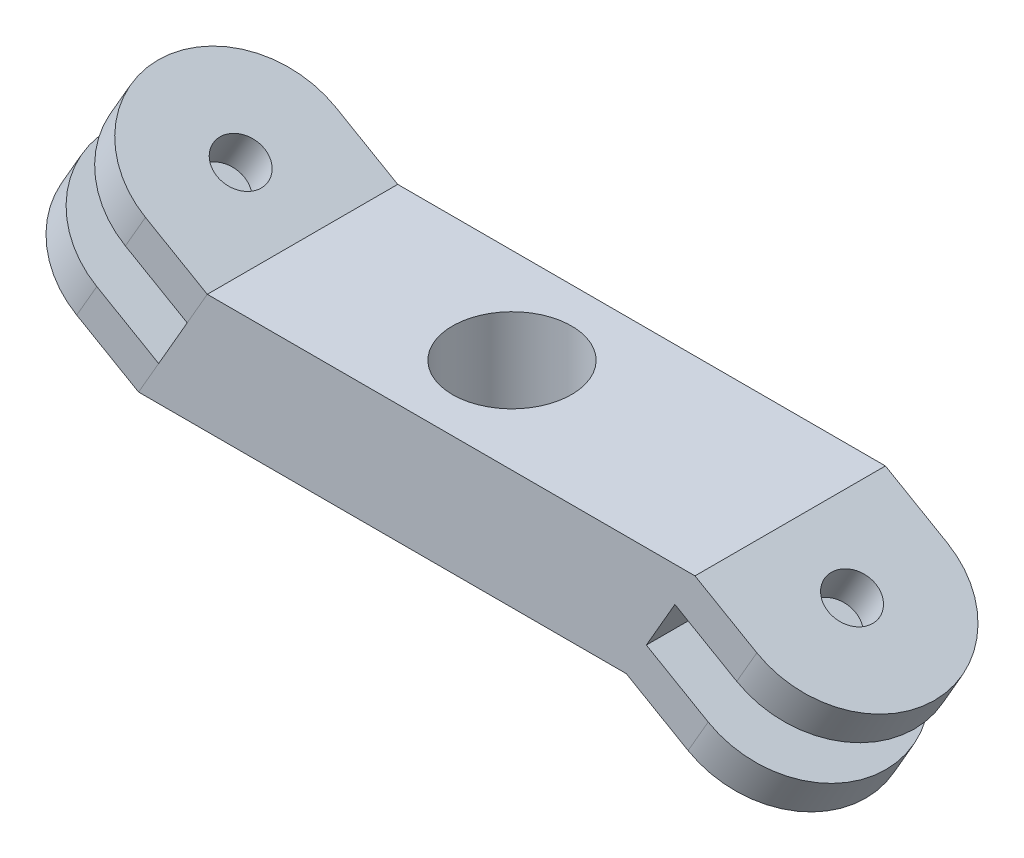
ISO-10303-21;
HEADER;
FILE_DESCRIPTION(('STEP AP214'),'2;1');
FILE_NAME('part.step','',(''),(''),'','','');
FILE_SCHEMA(('AUTOMOTIVE_DESIGN { 1 0 10303 214 1 1 1 1 }'));
ENDSEC;
DATA;
#1=APPLICATION_CONTEXT('core data for automotive mechanical design processes');
#2=APPLICATION_PROTOCOL_DEFINITION('international standard','automotive_design',2000,#1);
#3=PRODUCT_CONTEXT('',#1,'mechanical');
#4=PRODUCT('Part','Part','',(#3));
#5=PRODUCT_RELATED_PRODUCT_CATEGORY('part','',(#4));
#6=PRODUCT_DEFINITION_FORMATION('','',#4);
#7=PRODUCT_DEFINITION_CONTEXT('part definition',#1,'design');
#8=PRODUCT_DEFINITION('design','',#6,#7);
#9=PRODUCT_DEFINITION_SHAPE('','',#8);
#10=(LENGTH_UNIT() NAMED_UNIT(*) SI_UNIT(.MILLI.,.METRE.));
#11=(NAMED_UNIT(*) PLANE_ANGLE_UNIT() SI_UNIT($,.RADIAN.));
#12=(NAMED_UNIT(*) SI_UNIT($,.STERADIAN.) SOLID_ANGLE_UNIT());
#13=UNCERTAINTY_MEASURE_WITH_UNIT(LENGTH_MEASURE(1.E-05),#10,'distance_accuracy_value','');
#14=(GEOMETRIC_REPRESENTATION_CONTEXT(3) GLOBAL_UNCERTAINTY_ASSIGNED_CONTEXT((#13)) GLOBAL_UNIT_ASSIGNED_CONTEXT((#10,
#11,#12)) REPRESENTATION_CONTEXT('',''));
#15=CARTESIAN_POINT('',(0.,0.,0.));
#16=DIRECTION('',(0.,0.,1.));
#17=DIRECTION('',(1.,0.,0.));
#18=AXIS2_PLACEMENT_3D('',#15,#16,#17);
#19=CARTESIAN_POINT('',(-14.2853812281884,1.50000000000001,0.));
#20=DIRECTION('',(0.499999999999998,0.86602540378444,0.));
#21=DIRECTION('',(-0.86602540378444,0.499999999999998,0.));
#22=AXIS2_PLACEMENT_3D('',#19,#20,#21);
#23=CYLINDRICAL_SURFACE('',#22,4.);
#24=DIRECTION('',(0.499999999999998,0.86602540378444,0.));
#25=VECTOR('',#24,1.);
#26=CARTESIAN_POINT('',(-14.2853812281884,1.50000000000001,-4.));
#27=LINE('',#26,#25);
#28=CARTESIAN_POINT('',(-12.2420055552144,5.03923048454133,-4.));
#29=VERTEX_POINT('',#28);
#30=CARTESIAN_POINT('',(-11.3986298822403,6.5,-4.));
#31=VERTEX_POINT('',#30);
#32=EDGE_CURVE('E89',#29,#31,#27,.T.);
#33=ORIENTED_EDGE('',*,*,#32,.F.);
#34=CARTESIAN_POINT('',(-12.2420055552144,5.03923048454133,0.));
#35=DIRECTION('',(-0.499999999999998,-0.86602540378444,0.));
#36=DIRECTION('',(0.86602540378444,-0.499999999999998,0.));
#37=AXIS2_PLACEMENT_3D('',#34,#35,#36);
#38=CIRCLE('',#37,4.);
#39=CARTESIAN_POINT('',(-12.2420055552144,5.03923048454133,4.));
#40=VERTEX_POINT('',#39);
#41=EDGE_CURVE('E61',#29,#40,#38,.F.);
#42=ORIENTED_EDGE('',*,*,#41,.T.);
#43=DIRECTION('',(0.499999999999998,0.86602540378444,0.));
#44=VECTOR('',#43,1.);
#45=CARTESIAN_POINT('',(-14.2853812281884,1.50000000000001,4.));
#46=LINE('',#45,#44);
#47=CARTESIAN_POINT('',(-11.3986298822403,6.49999999999999,4.));
#48=VERTEX_POINT('',#47);
#49=EDGE_CURVE('E47',#40,#48,#46,.T.);
#50=ORIENTED_EDGE('',*,*,#49,.T.);
#51=CARTESIAN_POINT('',(-11.3986298822403,6.49999999999999,0.));
#52=DIRECTION('',(0.499999999999998,0.86602540378444,0.));
#53=DIRECTION('',(0.86602540378444,-0.499999999999998,0.));
#54=AXIS2_PLACEMENT_3D('',#51,#52,#53);
#55=CIRCLE('',#54,4.);
#56=EDGE_CURVE('E95',#31,#48,#55,.T.);
#57=ORIENTED_EDGE('',*,*,#56,.F.);
#58=EDGE_LOOP('',(#33,#42,#50,#57));
#59=FACE_BOUND('',#58,.T.);
#60=ADVANCED_FACE('F43',(#59),#23,.T.);
#61=CARTESIAN_POINT('',(-14.2853812281884,1.50000000000001,-4.));
#62=DIRECTION('',(0.,0.,-1.));
#63=DIRECTION('',(-1.,0.,0.));
#64=AXIS2_PLACEMENT_3D('',#61,#62,#63);
#65=PLANE('',#64);
#66=DIRECTION('',(0.499999999999998,0.86602540378444,0.));
#67=VECTOR('',#66,1.);
#68=CARTESIAN_POINT('',(-11.6873050168351,0.,-4.));
#69=LINE('',#68,#67);
#70=CARTESIAN_POINT('',(-9.64392934386108,3.53923048454133,-4.));
#71=VERTEX_POINT('',#70);
#72=CARTESIAN_POINT('',(-8.80055367088702,5.,-4.));
#73=VERTEX_POINT('',#72);
#74=EDGE_CURVE('E115',#71,#73,#69,.T.);
#75=ORIENTED_EDGE('',*,*,#74,.F.);
#76=DIRECTION('',(-0.86602540378444,0.499999999999998,0.));
#77=VECTOR('',#76,1.);
#78=CARTESIAN_POINT('',(-12.2420055552144,5.03923048454133,-4.));
#79=LINE('',#78,#77);
#80=EDGE_CURVE('E70',#71,#29,#79,.T.);
#81=ORIENTED_EDGE('',*,*,#80,.T.);
#82=ORIENTED_EDGE('',*,*,#32,.T.);
#83=DIRECTION('',(-0.86602540378444,0.499999999999998,0.));
#84=VECTOR('',#83,1.);
#85=CARTESIAN_POINT('',(-11.3986298822403,6.5,-4.));
#86=LINE('',#85,#84);
#87=EDGE_CURVE('E53',#73,#31,#86,.T.);
#88=ORIENTED_EDGE('',*,*,#87,.F.);
#89=EDGE_LOOP('',(#75,#81,#82,#88));
#90=FACE_BOUND('',#89,.T.);
#91=ADVANCED_FACE('F122',(#90),#65,.T.);
#92=CARTESIAN_POINT('',(-11.6873050168351,0.,4.));
#93=DIRECTION('',(0.86602540378444,-0.499999999999998,0.));
#94=DIRECTION('',(0.499999999999998,0.86602540378444,0.));
#95=AXIS2_PLACEMENT_3D('',#92,#93,#94);
#96=PLANE('',#95);
#97=DIRECTION('',(0.499999999999998,0.86602540378444,0.));
#98=VECTOR('',#97,1.);
#99=CARTESIAN_POINT('',(-11.6873050168351,0.,4.));
#100=LINE('',#99,#98);
#101=CARTESIAN_POINT('',(-9.64392934386108,3.53923048454133,4.));
#102=VERTEX_POINT('',#101);
#103=CARTESIAN_POINT('',(-8.80055367088702,5.,4.));
#104=VERTEX_POINT('',#103);
#105=EDGE_CURVE('E79',#102,#104,#100,.T.);
#106=ORIENTED_EDGE('',*,*,#105,.F.);
#107=DIRECTION('',(0.,0.,-1.));
#108=VECTOR('',#107,1.);
#109=CARTESIAN_POINT('',(-9.64392934386108,3.53923048454133,4.));
#110=LINE('',#109,#108);
#111=EDGE_CURVE('E113',#102,#71,#110,.T.);
#112=ORIENTED_EDGE('',*,*,#111,.T.);
#113=ORIENTED_EDGE('',*,*,#74,.T.);
#114=DIRECTION('',(0.,0.,-1.));
#115=VECTOR('',#114,1.);
#116=CARTESIAN_POINT('',(-8.80055367088702,5.,4.));
#117=LINE('',#116,#115);
#118=EDGE_CURVE('E102',#104,#73,#117,.T.);
#119=ORIENTED_EDGE('',*,*,#118,.F.);
#120=EDGE_LOOP('',(#106,#112,#113,#119));
#121=FACE_BOUND('',#120,.T.);
#122=ADVANCED_FACE('F121',(#121),#96,.T.);
#123=CARTESIAN_POINT('',(-14.2853812281884,1.50000000000001,4.));
#124=DIRECTION('',(0.,0.,1.));
#125=DIRECTION('',(1.,0.,0.));
#126=AXIS2_PLACEMENT_3D('',#123,#124,#125);
#127=PLANE('',#126);
#128=ORIENTED_EDGE('',*,*,#49,.F.);
#129=DIRECTION('',(0.86602540378444,-0.499999999999998,0.));
#130=VECTOR('',#129,1.);
#131=CARTESIAN_POINT('',(-12.2420055552144,5.03923048454133,4.));
#132=LINE('',#131,#130);
#133=EDGE_CURVE('E116',#40,#102,#132,.T.);
#134=ORIENTED_EDGE('',*,*,#133,.T.);
#135=ORIENTED_EDGE('',*,*,#105,.T.);
#136=DIRECTION('',(0.86602540378444,-0.499999999999998,0.));
#137=VECTOR('',#136,1.);
#138=CARTESIAN_POINT('',(-11.3986298822403,6.49999999999999,4.));
#139=LINE('',#138,#137);
#140=EDGE_CURVE('E98',#48,#104,#139,.T.);
#141=ORIENTED_EDGE('',*,*,#140,.F.);
#142=EDGE_LOOP('',(#128,#134,#135,#141));
#143=FACE_BOUND('',#142,.T.);
#144=ADVANCED_FACE('F99',(#143),#127,.T.);
#145=CARTESIAN_POINT('',(-15.6995947905615,-0.94948974278318,0.));
#146=DIRECTION('',(0.499999999999998,0.86602540378444,0.));
#147=DIRECTION('',(-0.86602540378444,0.499999999999998,0.));
#148=AXIS2_PLACEMENT_3D('',#145,#146,#147);
#149=CYLINDRICAL_SURFACE('',#148,1.);
#150=CARTESIAN_POINT('',(-11.3986298822403,6.49999999999999,0.));
#151=DIRECTION('',(0.499999999999998,0.86602540378444,0.));
#152=DIRECTION('',(-0.86602540378444,0.499999999999998,0.));
#153=AXIS2_PLACEMENT_3D('',#150,#151,#152);
#154=CIRCLE('',#153,1.);
#155=CARTESIAN_POINT('',(-12.2646552860248,6.99999999999999,0.));
#156=VERTEX_POINT('',#155);
#157=EDGE_CURVE('E105',#156,#156,#154,.T.);
#158=ORIENTED_EDGE('',*,*,#157,.T.);
#159=EDGE_LOOP('',(#158));
#160=FACE_BOUND('',#159,.T.);
#161=CARTESIAN_POINT('',(-12.2420055552144,5.03923048454133,0.));
#162=DIRECTION('',(-0.499999999999998,-0.86602540378444,0.));
#163=DIRECTION('',(0.86602540378444,-0.499999999999998,0.));
#164=AXIS2_PLACEMENT_3D('',#161,#162,#163);
#165=CIRCLE('',#164,1.);
#166=CARTESIAN_POINT('',(-11.37598015143,4.53923048454133,0.));
#167=VERTEX_POINT('',#166);
#168=EDGE_CURVE('E12',#167,#167,#165,.F.);
#169=ORIENTED_EDGE('',*,*,#168,.F.);
#170=EDGE_LOOP('',(#169));
#171=FACE_BOUND('',#170,.T.);
#172=ADVANCED_FACE('F45',(#160,#171),#149,.F.);
#173=CARTESIAN_POINT('',(-11.3986298822403,6.49999999999999,0.));
#174=DIRECTION('',(-0.499999999999998,-0.86602540378444,0.));
#175=DIRECTION('',(0.86602540378444,-0.499999999999998,0.));
#176=AXIS2_PLACEMENT_3D('',#173,#174,#175);
#177=PLANE('',#176);
#178=ORIENTED_EDGE('',*,*,#157,.F.);
#179=EDGE_LOOP('',(#178));
#180=FACE_BOUND('',#179,.T.);
#181=ORIENTED_EDGE('',*,*,#56,.T.);
#182=ORIENTED_EDGE('',*,*,#140,.T.);
#183=ORIENTED_EDGE('',*,*,#118,.T.);
#184=ORIENTED_EDGE('',*,*,#87,.T.);
#185=EDGE_LOOP('',(#181,#182,#183,#184));
#186=FACE_BOUND('',#185,.T.);
#187=ADVANCED_FACE('F104',(#180,#186),#177,.F.);
#188=CARTESIAN_POINT('',(-0.878450581234703,-1.52152103863692,0.));
#189=DIRECTION('',(-0.499999999999998,-0.86602540378444,0.));
#190=DIRECTION('',(0.86602540378444,-0.499999999999998,0.));
#191=AXIS2_PLACEMENT_3D('',#188,#189,#190);
#192=PLANE('',#191);
#193=ORIENTED_EDGE('',*,*,#80,.F.);
#194=ORIENTED_EDGE('',*,*,#111,.F.);
#195=ORIENTED_EDGE('',*,*,#133,.F.);
#196=ORIENTED_EDGE('',*,*,#41,.F.);
#197=EDGE_LOOP('',(#193,#194,#195,#196));
#198=FACE_BOUND('',#197,.T.);
#199=ORIENTED_EDGE('',*,*,#168,.T.);
#200=EDGE_LOOP('',(#199));
#201=FACE_BOUND('',#200,.T.);
#202=ADVANCED_FACE('F134',(#198,#201),#192,.T.);
#203=CLOSED_SHELL('',(#60,#91,#122,#144,#172,#187,#202));
#204=MANIFOLD_SOLID_BREP('B2',#203);
#205=CARTESIAN_POINT('',(-14.2853812281884,1.50000000000001,4.));
#206=DIRECTION('',(0.,0.,1.));
#207=DIRECTION('',(1.,0.,0.));
#208=AXIS2_PLACEMENT_3D('',#205,#206,#207);
#209=PLANE('',#208);
#210=DIRECTION('',(0.86602540378444,-0.499999999999998,0.));
#211=VECTOR('',#210,1.);
#212=CARTESIAN_POINT('',(-13.4420055552144,2.96076951545867,4.));
#213=LINE('',#212,#211);
#214=CARTESIAN_POINT('',(-13.4420055552144,2.96076951545867,4.));
#215=VERTEX_POINT('',#214);
#216=CARTESIAN_POINT('',(-10.8439293438611,1.46076951545868,4.));
#217=VERTEX_POINT('',#216);
#218=EDGE_CURVE('E235',#215,#217,#213,.T.);
#219=ORIENTED_EDGE('',*,*,#218,.F.);
#220=DIRECTION('',(0.499999999999998,0.86602540378444,0.));
#221=VECTOR('',#220,1.);
#222=CARTESIAN_POINT('',(-14.2853812281884,1.50000000000001,4.));
#223=LINE('',#222,#221);
#224=CARTESIAN_POINT('',(-14.2853812281884,1.50000000000001,4.));
#225=VERTEX_POINT('',#224);
#226=EDGE_CURVE('E256',#225,#215,#223,.T.);
#227=ORIENTED_EDGE('',*,*,#226,.F.);
#228=DIRECTION('',(0.86602540378444,-0.499999999999998,0.));
#229=VECTOR('',#228,1.);
#230=CARTESIAN_POINT('',(-14.2853812281884,1.50000000000001,4.));
#231=LINE('',#230,#229);
#232=CARTESIAN_POINT('',(-11.6873050168351,0.,4.));
#233=VERTEX_POINT('',#232);
#234=EDGE_CURVE('E255',#225,#233,#231,.T.);
#235=ORIENTED_EDGE('',*,*,#234,.T.);
#236=DIRECTION('',(0.499999999999998,0.86602540378444,0.));
#237=VECTOR('',#236,1.);
#238=CARTESIAN_POINT('',(-11.6873050168351,0.,4.));
#239=LINE('',#238,#237);
#240=EDGE_CURVE('E249',#233,#217,#239,.T.);
#241=ORIENTED_EDGE('',*,*,#240,.T.);
#242=EDGE_LOOP('',(#219,#227,#235,#241));
#243=FACE_BOUND('',#242,.T.);
#244=ADVANCED_FACE('F196',(#243),#209,.T.);
#245=CARTESIAN_POINT('',(-11.6873050168351,0.,4.));
#246=DIRECTION('',(0.86602540378444,-0.499999999999998,0.));
#247=DIRECTION('',(0.499999999999998,0.86602540378444,0.));
#248=AXIS2_PLACEMENT_3D('',#245,#246,#247);
#249=PLANE('',#248);
#250=DIRECTION('',(0.,0.,-1.));
#251=VECTOR('',#250,1.);
#252=CARTESIAN_POINT('',(-10.8439293438611,1.46076951545868,4.));
#253=LINE('',#252,#251);
#254=CARTESIAN_POINT('',(-10.8439293438611,1.46076951545868,-4.));
#255=VERTEX_POINT('',#254);
#256=EDGE_CURVE('E239',#217,#255,#253,.T.);
#257=ORIENTED_EDGE('',*,*,#256,.F.);
#258=ORIENTED_EDGE('',*,*,#240,.F.);
#259=DIRECTION('',(0.,0.,-1.));
#260=VECTOR('',#259,1.);
#261=CARTESIAN_POINT('',(-11.6873050168351,0.,4.));
#262=LINE('',#261,#260);
#263=CARTESIAN_POINT('',(-11.6873050168351,0.,-4.));
#264=VERTEX_POINT('',#263);
#265=EDGE_CURVE('E263',#233,#264,#262,.T.);
#266=ORIENTED_EDGE('',*,*,#265,.T.);
#267=DIRECTION('',(0.499999999999998,0.86602540378444,0.));
#268=VECTOR('',#267,1.);
#269=CARTESIAN_POINT('',(-11.6873050168351,0.,-4.));
#270=LINE('',#269,#268);
#271=EDGE_CURVE('E205',#264,#255,#270,.T.);
#272=ORIENTED_EDGE('',*,*,#271,.T.);
#273=EDGE_LOOP('',(#257,#258,#266,#272));
#274=FACE_BOUND('',#273,.T.);
#275=ADVANCED_FACE('F247',(#274),#249,.T.);
#276=CARTESIAN_POINT('',(-14.2853812281884,1.50000000000001,-4.));
#277=DIRECTION('',(0.,0.,-1.));
#278=DIRECTION('',(-1.,0.,0.));
#279=AXIS2_PLACEMENT_3D('',#276,#277,#278);
#280=PLANE('',#279);
#281=DIRECTION('',(-0.86602540378444,0.499999999999998,0.));
#282=VECTOR('',#281,1.);
#283=CARTESIAN_POINT('',(-13.4420055552144,2.96076951545867,-4.));
#284=LINE('',#283,#282);
#285=CARTESIAN_POINT('',(-13.4420055552144,2.96076951545867,-4.));
#286=VERTEX_POINT('',#285);
#287=EDGE_CURVE('E251',#255,#286,#284,.T.);
#288=ORIENTED_EDGE('',*,*,#287,.F.);
#289=ORIENTED_EDGE('',*,*,#271,.F.);
#290=DIRECTION('',(-0.86602540378444,0.499999999999998,0.));
#291=VECTOR('',#290,1.);
#292=CARTESIAN_POINT('',(-14.2853812281884,1.50000000000001,-4.));
#293=LINE('',#292,#291);
#294=CARTESIAN_POINT('',(-14.2853812281884,1.50000000000001,-4.));
#295=VERTEX_POINT('',#294);
#296=EDGE_CURVE('E259',#264,#295,#293,.T.);
#297=ORIENTED_EDGE('',*,*,#296,.T.);
#298=DIRECTION('',(0.499999999999998,0.86602540378444,0.));
#299=VECTOR('',#298,1.);
#300=CARTESIAN_POINT('',(-14.2853812281884,1.50000000000001,-4.));
#301=LINE('',#300,#299);
#302=EDGE_CURVE('E41',#295,#286,#301,.T.);
#303=ORIENTED_EDGE('',*,*,#302,.T.);
#304=EDGE_LOOP('',(#288,#289,#297,#303));
#305=FACE_BOUND('',#304,.T.);
#306=ADVANCED_FACE('F273',(#305),#280,.T.);
#307=CARTESIAN_POINT('',(-14.2853812281884,1.50000000000001,0.));
#308=DIRECTION('',(0.499999999999998,0.86602540378444,0.));
#309=DIRECTION('',(-0.86602540378444,0.499999999999998,0.));
#310=AXIS2_PLACEMENT_3D('',#307,#308,#309);
#311=CYLINDRICAL_SURFACE('',#310,4.);
#312=CARTESIAN_POINT('',(-13.4420055552144,2.96076951545867,0.));
#313=DIRECTION('',(-0.499999999999998,-0.86602540378444,0.));
#314=DIRECTION('',(0.86602540378444,-0.499999999999998,0.));
#315=AXIS2_PLACEMENT_3D('',#312,#313,#314);
#316=CIRCLE('',#315,4.);
#317=EDGE_CURVE('E213',#286,#215,#316,.F.);
#318=ORIENTED_EDGE('',*,*,#317,.F.);
#319=ORIENTED_EDGE('',*,*,#302,.F.);
#320=CARTESIAN_POINT('',(-14.2853812281884,1.50000000000001,0.));
#321=DIRECTION('',(0.499999999999998,0.86602540378444,0.));
#322=DIRECTION('',(0.86602540378444,-0.499999999999998,0.));
#323=AXIS2_PLACEMENT_3D('',#320,#321,#322);
#324=CIRCLE('',#323,4.);
#325=EDGE_CURVE('E266',#295,#225,#324,.T.);
#326=ORIENTED_EDGE('',*,*,#325,.T.);
#327=ORIENTED_EDGE('',*,*,#226,.T.);
#328=EDGE_LOOP('',(#318,#319,#326,#327));
#329=FACE_BOUND('',#328,.T.);
#330=ADVANCED_FACE('F198',(#329),#311,.T.);
#331=CARTESIAN_POINT('',(-14.2853812281884,1.50000000000001,0.));
#332=DIRECTION('',(-0.499999999999998,-0.86602540378444,0.));
#333=DIRECTION('',(0.86602540378444,-0.499999999999998,0.));
#334=AXIS2_PLACEMENT_3D('',#331,#332,#333);
#335=PLANE('',#334);
#336=CARTESIAN_POINT('',(-14.2853812281884,1.50000000000001,0.));
#337=DIRECTION('',(-0.499999999999998,-0.86602540378444,0.));
#338=DIRECTION('',(0.86602540378444,-0.499999999999998,0.));
#339=AXIS2_PLACEMENT_3D('',#336,#337,#338);
#340=CIRCLE('',#339,1.);
#341=CARTESIAN_POINT('',(-13.419355824404,1.00000000000001,0.));
#342=VERTEX_POINT('',#341);
#343=EDGE_CURVE('E268',#342,#342,#340,.F.);
#344=ORIENTED_EDGE('',*,*,#343,.T.);
#345=EDGE_LOOP('',(#344));
#346=FACE_BOUND('',#345,.T.);
#347=ORIENTED_EDGE('',*,*,#325,.F.);
#348=ORIENTED_EDGE('',*,*,#296,.F.);
#349=ORIENTED_EDGE('',*,*,#265,.F.);
#350=ORIENTED_EDGE('',*,*,#234,.F.);
#351=EDGE_LOOP('',(#347,#348,#349,#350));
#352=FACE_BOUND('',#351,.T.);
#353=ADVANCED_FACE('F276',(#346,#352),#335,.T.);
#354=CARTESIAN_POINT('',(-15.6995947905615,-0.94948974278318,0.));
#355=DIRECTION('',(0.499999999999998,0.86602540378444,0.));
#356=DIRECTION('',(-0.86602540378444,0.499999999999998,0.));
#357=AXIS2_PLACEMENT_3D('',#354,#355,#356);
#358=CYLINDRICAL_SURFACE('',#357,1.);
#359=CARTESIAN_POINT('',(-13.4420055552144,2.96076951545867,0.));
#360=DIRECTION('',(-0.499999999999998,-0.86602540378444,0.));
#361=DIRECTION('',(0.86602540378444,-0.499999999999998,0.));
#362=AXIS2_PLACEMENT_3D('',#359,#360,#361);
#363=CIRCLE('',#362,1.);
#364=CARTESIAN_POINT('',(-12.5759801514299,2.46076951545867,0.));
#365=VERTEX_POINT('',#364);
#366=EDGE_CURVE('E200',#365,#365,#363,.F.);
#367=ORIENTED_EDGE('',*,*,#366,.T.);
#368=EDGE_LOOP('',(#367));
#369=FACE_BOUND('',#368,.T.);
#370=ORIENTED_EDGE('',*,*,#343,.F.);
#371=EDGE_LOOP('',(#370));
#372=FACE_BOUND('',#371,.T.);
#373=ADVANCED_FACE('F278',(#369,#372),#358,.F.);
#374=CARTESIAN_POINT('',(-2.0784505812347,-3.59998200771958,0.));
#375=DIRECTION('',(-0.499999999999998,-0.86602540378444,0.));
#376=DIRECTION('',(0.86602540378444,-0.499999999999998,0.));
#377=AXIS2_PLACEMENT_3D('',#374,#375,#376);
#378=PLANE('',#377);
#379=ORIENTED_EDGE('',*,*,#317,.T.);
#380=ORIENTED_EDGE('',*,*,#218,.T.);
#381=ORIENTED_EDGE('',*,*,#256,.T.);
#382=ORIENTED_EDGE('',*,*,#287,.T.);
#383=EDGE_LOOP('',(#379,#380,#381,#382));
#384=FACE_BOUND('',#383,.T.);
#385=ORIENTED_EDGE('',*,*,#366,.F.);
#386=EDGE_LOOP('',(#385));
#387=FACE_BOUND('',#386,.T.);
#388=ADVANCED_FACE('F237',(#384,#387),#378,.F.);
#389=CLOSED_SHELL('',(#244,#275,#306,#330,#353,#373,#388));
#390=MANIFOLD_SOLID_BREP('B6',#389);
#391=CARTESIAN_POINT('',(0.,0.,0.));
#392=DIRECTION('',(0.,1.,0.));
#393=DIRECTION('',(0.,0.,1.));
#394=AXIS2_PLACEMENT_3D('',#391,#392,#393);
#395=PLANE('',#394);
#396=CARTESIAN_POINT('',(0.,0.,0.));
#397=DIRECTION('',(0.,1.,0.));
#398=DIRECTION('',(0.,0.,1.));
#399=AXIS2_PLACEMENT_3D('',#396,#397,#398);
#400=CIRCLE('',#399,2.5);
#401=CARTESIAN_POINT('',(0.,0.,2.5));
#402=VERTEX_POINT('',#401);
#403=EDGE_CURVE('E194',#402,#402,#400,.F.);
#404=ORIENTED_EDGE('',*,*,#403,.F.);
#405=EDGE_LOOP('',(#404));
#406=FACE_BOUND('',#405,.T.);
#407=DIRECTION('',(0.,0.,-1.));
#408=VECTOR('',#407,1.);
#409=CARTESIAN_POINT('',(8.80055367088702,0.,0.));
#410=LINE('',#409,#408);
#411=CARTESIAN_POINT('',(8.80055367088702,0.,4.));
#412=VERTEX_POINT('',#411);
#413=CARTESIAN_POINT('',(8.80055367088702,0.,-4.));
#414=VERTEX_POINT('',#413);
#415=EDGE_CURVE('E490',#412,#414,#410,.T.);
#416=ORIENTED_EDGE('',*,*,#415,.F.);
#417=DIRECTION('',(1.,0.,0.));
#418=VECTOR('',#417,1.);
#419=CARTESIAN_POINT('',(-3.07009589621998,0.,4.));
#420=LINE('',#419,#418);
#421=CARTESIAN_POINT('',(-11.6873050168351,0.,4.));
#422=VERTEX_POINT('',#421);
#423=EDGE_CURVE('E506',#422,#412,#420,.T.);
#424=ORIENTED_EDGE('',*,*,#423,.F.);
#425=DIRECTION('',(0.,0.,1.));
#426=VECTOR('',#425,1.);
#427=CARTESIAN_POINT('',(-11.6873050168351,0.,-4.));
#428=LINE('',#427,#426);
#429=CARTESIAN_POINT('',(-11.6873050168351,0.,-4.));
#430=VERTEX_POINT('',#429);
#431=EDGE_CURVE('E513',#430,#422,#428,.T.);
#432=ORIENTED_EDGE('',*,*,#431,.F.);
#433=DIRECTION('',(1.,0.,0.));
#434=VECTOR('',#433,1.);
#435=CARTESIAN_POINT('',(-3.07009589621998,0.,-4.));
#436=LINE('',#435,#434);
#437=EDGE_CURVE('E511',#430,#414,#436,.T.);
#438=ORIENTED_EDGE('',*,*,#437,.T.);
#439=EDGE_LOOP('',(#416,#424,#432,#438));
#440=FACE_BOUND('',#439,.T.);
#441=ADVANCED_FACE('F340',(#406,#440),#395,.F.);
#442=CARTESIAN_POINT('',(0.,5.,0.));
#443=DIRECTION('',(0.,1.,0.));
#444=DIRECTION('',(0.,0.,1.));
#445=AXIS2_PLACEMENT_3D('',#442,#443,#444);
#446=PLANE('',#445);
#447=DIRECTION('',(-1.,0.,0.));
#448=VECTOR('',#447,1.);
#449=CARTESIAN_POINT('',(-3.07009589621998,5.,4.));
#450=LINE('',#449,#448);
#451=CARTESIAN_POINT('',(11.6873050168351,4.99999999999999,4.));
#452=VERTEX_POINT('',#451);
#453=CARTESIAN_POINT('',(-8.80055367088702,5.,4.));
#454=VERTEX_POINT('',#453);
#455=EDGE_CURVE('E504',#452,#454,#450,.T.);
#456=ORIENTED_EDGE('',*,*,#455,.F.);
#457=DIRECTION('',(0.,0.,1.));
#458=VECTOR('',#457,1.);
#459=CARTESIAN_POINT('',(11.6873050168351,5.,-4.));
#460=LINE('',#459,#458);
#461=CARTESIAN_POINT('',(11.6873050168351,5.,-4.));
#462=VERTEX_POINT('',#461);
#463=EDGE_CURVE('E493',#462,#452,#460,.T.);
#464=ORIENTED_EDGE('',*,*,#463,.F.);
#465=DIRECTION('',(-1.,0.,0.));
#466=VECTOR('',#465,1.);
#467=CARTESIAN_POINT('',(-3.07009589621998,5.,-4.));
#468=LINE('',#467,#466);
#469=CARTESIAN_POINT('',(-8.80055367088702,5.,-4.));
#470=VERTEX_POINT('',#469);
#471=EDGE_CURVE('E508',#462,#470,#468,.T.);
#472=ORIENTED_EDGE('',*,*,#471,.T.);
#473=DIRECTION('',(0.,0.,1.));
#474=VECTOR('',#473,1.);
#475=CARTESIAN_POINT('',(-8.80055367088702,5.,0.));
#476=LINE('',#475,#474);
#477=EDGE_CURVE('E501',#470,#454,#476,.T.);
#478=ORIENTED_EDGE('',*,*,#477,.T.);
#479=EDGE_LOOP('',(#456,#464,#472,#478));
#480=FACE_BOUND('',#479,.T.);
#481=CARTESIAN_POINT('',(0.,5.,0.));
#482=DIRECTION('',(0.,1.,0.));
#483=DIRECTION('',(0.,0.,1.));
#484=AXIS2_PLACEMENT_3D('',#481,#482,#483);
#485=CIRCLE('',#484,2.5);
#486=CARTESIAN_POINT('',(0.,5.,2.5));
#487=VERTEX_POINT('',#486);
#488=EDGE_CURVE('E347',#487,#487,#485,.T.);
#489=ORIENTED_EDGE('',*,*,#488,.F.);
#490=EDGE_LOOP('',(#489));
#491=FACE_BOUND('',#490,.T.);
#492=ADVANCED_FACE('F519',(#480,#491),#446,.T.);
#493=CARTESIAN_POINT('',(0.,0.,-4.));
#494=DIRECTION('',(0.,0.,1.));
#495=DIRECTION('',(1.,0.,0.));
#496=AXIS2_PLACEMENT_3D('',#493,#494,#495);
#497=PLANE('',#496);
#498=DIRECTION('',(-0.499999999999998,-0.86602540378444,0.));
#499=VECTOR('',#498,1.);
#500=CARTESIAN_POINT('',(-8.76547876262637,5.06075152317826,-4.));
#501=LINE('',#500,#499);
#502=EDGE_CURVE('E499',#470,#430,#501,.T.);
#503=ORIENTED_EDGE('',*,*,#502,.F.);
#504=ORIENTED_EDGE('',*,*,#471,.F.);
#505=DIRECTION('',(0.86602540378444,-0.499999999999998,0.));
#506=VECTOR('',#505,1.);
#507=CARTESIAN_POINT('',(14.2853812281884,3.49999999999999,-4.));
#508=LINE('',#507,#506);
#509=CARTESIAN_POINT('',(14.2853812281884,3.49999999999999,-4.));
#510=VERTEX_POINT('',#509);
#511=EDGE_CURVE('E471',#462,#510,#508,.T.);
#512=ORIENTED_EDGE('',*,*,#511,.T.);
#513=DIRECTION('',(-0.499999999999998,-0.86602540378444,0.));
#514=VECTOR('',#513,1.);
#515=CARTESIAN_POINT('',(14.2853812281884,3.49999999999999,-4.));
#516=LINE('',#515,#514);
#517=CARTESIAN_POINT('',(13.4420055552144,2.03923048454133,-4.));
#518=VERTEX_POINT('',#517);
#519=EDGE_CURVE('E473',#510,#518,#516,.T.);
#520=ORIENTED_EDGE('',*,*,#519,.T.);
#521=DIRECTION('',(0.86602540378444,-0.499999999999998,0.));
#522=VECTOR('',#521,1.);
#523=CARTESIAN_POINT('',(13.4420055552144,2.03923048454133,-4.));
#524=LINE('',#523,#522);
#525=CARTESIAN_POINT('',(10.8439293438611,3.53923048454132,-4.));
#526=VERTEX_POINT('',#525);
#527=EDGE_CURVE('E469',#526,#518,#524,.T.);
#528=ORIENTED_EDGE('',*,*,#527,.F.);
#529=DIRECTION('',(0.499999999999998,0.86602540378444,0.));
#530=VECTOR('',#529,1.);
#531=CARTESIAN_POINT('',(6.60041525316528,-3.81075152317827,-4.));
#532=LINE('',#531,#530);
#533=CARTESIAN_POINT('',(9.64392934386107,1.46076951545867,-4.));
#534=VERTEX_POINT('',#533);
#535=EDGE_CURVE('E439',#534,#526,#532,.T.);
#536=ORIENTED_EDGE('',*,*,#535,.F.);
#537=DIRECTION('',(0.86602540378444,-0.499999999999998,0.));
#538=VECTOR('',#537,1.);
#539=CARTESIAN_POINT('',(12.2420055552144,-0.0392304845413284,-4.));
#540=LINE('',#539,#538);
#541=CARTESIAN_POINT('',(12.2420055552144,-0.0392304845413293,-4.));
#542=VERTEX_POINT('',#541);
#543=EDGE_CURVE('E432',#534,#542,#540,.T.);
#544=ORIENTED_EDGE('',*,*,#543,.T.);
#545=DIRECTION('',(-0.499999999999998,-0.86602540378444,0.));
#546=VECTOR('',#545,1.);
#547=CARTESIAN_POINT('',(14.2853812281884,3.49999999999999,-4.));
#548=LINE('',#547,#546);
#549=CARTESIAN_POINT('',(11.3986298822403,-1.5,-4.));
#550=VERTEX_POINT('',#549);
#551=EDGE_CURVE('E415',#542,#550,#548,.T.);
#552=ORIENTED_EDGE('',*,*,#551,.T.);
#553=DIRECTION('',(0.86602540378444,-0.499999999999998,0.));
#554=VECTOR('',#553,1.);
#555=CARTESIAN_POINT('',(11.3986298822403,-1.5,-4.));
#556=LINE('',#555,#554);
#557=EDGE_CURVE('E440',#414,#550,#556,.T.);
#558=ORIENTED_EDGE('',*,*,#557,.F.);
#559=ORIENTED_EDGE('',*,*,#437,.F.);
#560=EDGE_LOOP('',(#503,#504,#512,#520,#528,#536,#544,#552,#558,#559));
#561=FACE_BOUND('',#560,.T.);
#562=ADVANCED_FACE('F437',(#561),#497,.F.);
#563=CARTESIAN_POINT('',(0.,0.,4.));
#564=DIRECTION('',(0.,0.,1.));
#565=DIRECTION('',(1.,0.,0.));
#566=AXIS2_PLACEMENT_3D('',#563,#564,#565);
#567=PLANE('',#566);
#568=ORIENTED_EDGE('',*,*,#423,.T.);
#569=DIRECTION('',(-0.86602540378444,0.499999999999998,0.));
#570=VECTOR('',#569,1.);
#571=CARTESIAN_POINT('',(11.3986298822403,-1.49999999999999,4.));
#572=LINE('',#571,#570);
#573=CARTESIAN_POINT('',(11.3986298822403,-1.49999999999999,4.));
#574=VERTEX_POINT('',#573);
#575=EDGE_CURVE('E448',#574,#412,#572,.T.);
#576=ORIENTED_EDGE('',*,*,#575,.F.);
#577=DIRECTION('',(-0.499999999999998,-0.86602540378444,0.));
#578=VECTOR('',#577,1.);
#579=CARTESIAN_POINT('',(14.2853812281884,3.49999999999999,4.));
#580=LINE('',#579,#578);
#581=CARTESIAN_POINT('',(12.2420055552144,-0.0392304845413293,4.));
#582=VERTEX_POINT('',#581);
#583=EDGE_CURVE('E434',#582,#574,#580,.T.);
#584=ORIENTED_EDGE('',*,*,#583,.F.);
#585=DIRECTION('',(-0.86602540378444,0.499999999999998,0.));
#586=VECTOR('',#585,1.);
#587=CARTESIAN_POINT('',(12.2420055552144,-0.0392304845413284,4.));
#588=LINE('',#587,#586);
#589=CARTESIAN_POINT('',(9.64392934386108,1.46076951545867,4.));
#590=VERTEX_POINT('',#589);
#591=EDGE_CURVE('E433',#582,#590,#588,.T.);
#592=ORIENTED_EDGE('',*,*,#591,.T.);
#593=DIRECTION('',(0.499999999999998,0.86602540378444,0.));
#594=VECTOR('',#593,1.);
#595=CARTESIAN_POINT('',(6.60041525316528,-3.81075152317827,4.));
#596=LINE('',#595,#594);
#597=CARTESIAN_POINT('',(10.8439293438611,3.53923048454132,4.));
#598=VERTEX_POINT('',#597);
#599=EDGE_CURVE('E361',#590,#598,#596,.T.);
#600=ORIENTED_EDGE('',*,*,#599,.T.);
#601=DIRECTION('',(-0.86602540378444,0.499999999999998,0.));
#602=VECTOR('',#601,1.);
#603=CARTESIAN_POINT('',(13.4420055552144,2.03923048454133,4.));
#604=LINE('',#603,#602);
#605=CARTESIAN_POINT('',(13.4420055552144,2.03923048454133,4.));
#606=VERTEX_POINT('',#605);
#607=EDGE_CURVE('E457',#606,#598,#604,.T.);
#608=ORIENTED_EDGE('',*,*,#607,.F.);
#609=DIRECTION('',(-0.499999999999998,-0.86602540378444,0.));
#610=VECTOR('',#609,1.);
#611=CARTESIAN_POINT('',(14.2853812281884,3.49999999999999,4.));
#612=LINE('',#611,#610);
#613=CARTESIAN_POINT('',(14.2853812281884,3.49999999999999,4.));
#614=VERTEX_POINT('',#613);
#615=EDGE_CURVE('E460',#614,#606,#612,.T.);
#616=ORIENTED_EDGE('',*,*,#615,.F.);
#617=DIRECTION('',(-0.86602540378444,0.499999999999998,0.));
#618=VECTOR('',#617,1.);
#619=CARTESIAN_POINT('',(14.2853812281884,3.49999999999999,4.));
#620=LINE('',#619,#618);
#621=EDGE_CURVE('E463',#614,#452,#620,.T.);
#622=ORIENTED_EDGE('',*,*,#621,.T.);
#623=ORIENTED_EDGE('',*,*,#455,.T.);
#624=DIRECTION('',(-0.499999999999998,-0.86602540378444,0.));
#625=VECTOR('',#624,1.);
#626=CARTESIAN_POINT('',(-8.76547876262637,5.06075152317826,4.));
#627=LINE('',#626,#625);
#628=EDGE_CURVE('E496',#454,#422,#627,.T.);
#629=ORIENTED_EDGE('',*,*,#628,.T.);
#630=EDGE_LOOP('',(#568,#576,#584,#592,#600,#608,#616,#622,#623,#629));
#631=FACE_BOUND('',#630,.T.);
#632=ADVANCED_FACE('F526',(#631),#567,.T.);
#633=CARTESIAN_POINT('',(0.,-7.07106781186548,0.));
#634=DIRECTION('',(0.,1.,0.));
#635=DIRECTION('',(0.,0.,1.));
#636=AXIS2_PLACEMENT_3D('',#633,#634,#635);
#637=CYLINDRICAL_SURFACE('',#636,2.5);
#638=ORIENTED_EDGE('',*,*,#403,.T.);
#639=EDGE_LOOP('',(#638));
#640=FACE_BOUND('',#639,.T.);
#641=ORIENTED_EDGE('',*,*,#488,.T.);
#642=EDGE_LOOP('',(#641));
#643=FACE_BOUND('',#642,.T.);
#644=ADVANCED_FACE('F517',(#640,#643),#637,.F.);
#645=CARTESIAN_POINT('',(-8.76547876262637,5.06075152317826,0.));
#646=DIRECTION('',(-0.86602540378444,0.499999999999998,0.));
#647=DIRECTION('',(-0.499999999999998,-0.86602540378444,0.));
#648=AXIS2_PLACEMENT_3D('',#645,#646,#647);
#649=PLANE('',#648);
#650=ORIENTED_EDGE('',*,*,#502,.T.);
#651=ORIENTED_EDGE('',*,*,#431,.T.);
#652=ORIENTED_EDGE('',*,*,#628,.F.);
#653=ORIENTED_EDGE('',*,*,#477,.F.);
#654=EDGE_LOOP('',(#650,#651,#652,#653));
#655=FACE_BOUND('',#654,.T.);
#656=ADVANCED_FACE('F531',(#655),#649,.T.);
#657=CARTESIAN_POINT('',(8.76547876262637,-0.0607515231782563,0.));
#658=DIRECTION('',(0.86602540378444,-0.499999999999998,0.));
#659=DIRECTION('',(0.499999999999998,0.86602540378444,0.));
#660=AXIS2_PLACEMENT_3D('',#657,#658,#659);
#661=PLANE('',#660);
#662=DIRECTION('',(0.,0.,-1.));
#663=VECTOR('',#662,1.);
#664=CARTESIAN_POINT('',(9.64392934386108,1.46076951545867,4.));
#665=LINE('',#664,#663);
#666=EDGE_CURVE('E354',#590,#534,#665,.T.);
#667=ORIENTED_EDGE('',*,*,#666,.T.);
#668=ORIENTED_EDGE('',*,*,#535,.T.);
#669=DIRECTION('',(0.,0.,-1.));
#670=VECTOR('',#669,1.);
#671=CARTESIAN_POINT('',(10.8439293438611,3.53923048454132,4.));
#672=LINE('',#671,#670);
#673=EDGE_CURVE('E466',#598,#526,#672,.T.);
#674=ORIENTED_EDGE('',*,*,#673,.F.);
#675=ORIENTED_EDGE('',*,*,#599,.F.);
#676=EDGE_LOOP('',(#667,#668,#674,#675));
#677=FACE_BOUND('',#676,.T.);
#678=ADVANCED_FACE('F538',(#677),#661,.T.);
#679=CARTESIAN_POINT('',(14.2853812281884,3.49999999999999,0.));
#680=DIRECTION('',(-0.499999999999998,-0.86602540378444,0.));
#681=DIRECTION('',(0.86602540378444,-0.499999999999998,0.));
#682=AXIS2_PLACEMENT_3D('',#679,#680,#681);
#683=CYLINDRICAL_SURFACE('',#682,4.);
#684=CARTESIAN_POINT('',(13.4420055552144,2.03923048454133,0.));
#685=DIRECTION('',(0.499999999999998,0.86602540378444,0.));
#686=DIRECTION('',(-0.86602540378444,0.499999999999998,0.));
#687=AXIS2_PLACEMENT_3D('',#684,#685,#686);
#688=CIRCLE('',#687,4.);
#689=EDGE_CURVE('E476',#518,#606,#688,.F.);
#690=ORIENTED_EDGE('',*,*,#689,.F.);
#691=ORIENTED_EDGE('',*,*,#519,.F.);
#692=CARTESIAN_POINT('',(14.2853812281884,3.49999999999999,0.));
#693=DIRECTION('',(-0.499999999999998,-0.86602540378444,0.));
#694=DIRECTION('',(-0.86602540378444,0.499999999999998,0.));
#695=AXIS2_PLACEMENT_3D('',#692,#693,#694);
#696=CIRCLE('',#695,4.);
#697=EDGE_CURVE('E479',#510,#614,#696,.T.);
#698=ORIENTED_EDGE('',*,*,#697,.T.);
#699=ORIENTED_EDGE('',*,*,#615,.T.);
#700=EDGE_LOOP('',(#690,#691,#698,#699));
#701=FACE_BOUND('',#700,.T.);
#702=ADVANCED_FACE('F542',(#701),#683,.T.);
#703=CARTESIAN_POINT('',(14.2853812281884,3.49999999999999,0.));
#704=DIRECTION('',(0.499999999999998,0.86602540378444,0.));
#705=DIRECTION('',(-0.86602540378444,0.499999999999998,0.));
#706=AXIS2_PLACEMENT_3D('',#703,#704,#705);
#707=PLANE('',#706);
#708=CARTESIAN_POINT('',(14.2853812281884,3.49999999999999,0.));
#709=DIRECTION('',(0.499999999999998,0.86602540378444,0.));
#710=DIRECTION('',(-0.86602540378444,0.499999999999998,0.));
#711=AXIS2_PLACEMENT_3D('',#708,#709,#710);
#712=CIRCLE('',#711,1.);
#713=CARTESIAN_POINT('',(13.419355824404,3.99999999999999,0.));
#714=VERTEX_POINT('',#713);
#715=EDGE_CURVE('E482',#714,#714,#712,.F.);
#716=ORIENTED_EDGE('',*,*,#715,.T.);
#717=EDGE_LOOP('',(#716));
#718=FACE_BOUND('',#717,.T.);
#719=ORIENTED_EDGE('',*,*,#697,.F.);
#720=ORIENTED_EDGE('',*,*,#511,.F.);
#721=ORIENTED_EDGE('',*,*,#463,.T.);
#722=ORIENTED_EDGE('',*,*,#621,.F.);
#723=EDGE_LOOP('',(#719,#720,#721,#722));
#724=FACE_BOUND('',#723,.T.);
#725=ADVANCED_FACE('F550',(#718,#724),#707,.T.);
#726=CARTESIAN_POINT('',(15.6995947905615,5.94948974278318,0.));
#727=DIRECTION('',(-0.499999999999998,-0.86602540378444,0.));
#728=DIRECTION('',(0.86602540378444,-0.499999999999998,0.));
#729=AXIS2_PLACEMENT_3D('',#726,#727,#728);
#730=CYLINDRICAL_SURFACE('',#729,1.);
#731=CARTESIAN_POINT('',(13.4420055552144,2.03923048454133,0.));
#732=DIRECTION('',(0.499999999999998,0.86602540378444,0.));
#733=DIRECTION('',(-0.86602540378444,0.499999999999998,0.));
#734=AXIS2_PLACEMENT_3D('',#731,#732,#733);
#735=CIRCLE('',#734,1.);
#736=CARTESIAN_POINT('',(12.5759801514299,2.53923048454133,0.));
#737=VERTEX_POINT('',#736);
#738=EDGE_CURVE('E485',#737,#737,#735,.F.);
#739=ORIENTED_EDGE('',*,*,#738,.T.);
#740=EDGE_LOOP('',(#739));
#741=FACE_BOUND('',#740,.T.);
#742=ORIENTED_EDGE('',*,*,#715,.F.);
#743=EDGE_LOOP('',(#742));
#744=FACE_BOUND('',#743,.T.);
#745=ADVANCED_FACE('F546',(#741,#744),#730,.F.);
#746=CARTESIAN_POINT('',(2.0784505812347,8.59998200771958,0.));
#747=DIRECTION('',(0.499999999999998,0.86602540378444,0.));
#748=DIRECTION('',(-0.86602540378444,0.499999999999998,0.));
#749=AXIS2_PLACEMENT_3D('',#746,#747,#748);
#750=PLANE('',#749);
#751=ORIENTED_EDGE('',*,*,#689,.T.);
#752=ORIENTED_EDGE('',*,*,#607,.T.);
#753=ORIENTED_EDGE('',*,*,#673,.T.);
#754=ORIENTED_EDGE('',*,*,#527,.T.);
#755=EDGE_LOOP('',(#751,#752,#753,#754));
#756=FACE_BOUND('',#755,.T.);
#757=ORIENTED_EDGE('',*,*,#738,.F.);
#758=EDGE_LOOP('',(#757));
#759=FACE_BOUND('',#758,.T.);
#760=ADVANCED_FACE('F543',(#756,#759),#750,.F.);
#761=CARTESIAN_POINT('',(14.2853812281884,3.49999999999999,0.));
#762=DIRECTION('',(-0.499999999999998,-0.86602540378444,0.));
#763=DIRECTION('',(0.86602540378444,-0.499999999999998,0.));
#764=AXIS2_PLACEMENT_3D('',#761,#762,#763);
#765=CYLINDRICAL_SURFACE('',#764,4.);
#766=ORIENTED_EDGE('',*,*,#551,.F.);
#767=CARTESIAN_POINT('',(12.2420055552144,-0.0392304845413275,0.));
#768=DIRECTION('',(0.499999999999998,0.86602540378444,0.));
#769=DIRECTION('',(-0.86602540378444,0.499999999999998,0.));
#770=AXIS2_PLACEMENT_3D('',#767,#768,#769);
#771=CIRCLE('',#770,4.);
#772=EDGE_CURVE('E418',#542,#582,#771,.F.);
#773=ORIENTED_EDGE('',*,*,#772,.T.);
#774=ORIENTED_EDGE('',*,*,#583,.T.);
#775=CARTESIAN_POINT('',(11.3986298822403,-1.49999999999999,0.));
#776=DIRECTION('',(-0.499999999999998,-0.86602540378444,0.));
#777=DIRECTION('',(-0.86602540378444,0.499999999999998,0.));
#778=AXIS2_PLACEMENT_3D('',#775,#776,#777);
#779=CIRCLE('',#778,4.);
#780=EDGE_CURVE('E421',#550,#574,#779,.T.);
#781=ORIENTED_EDGE('',*,*,#780,.F.);
#782=EDGE_LOOP('',(#766,#773,#774,#781));
#783=FACE_BOUND('',#782,.T.);
#784=ADVANCED_FACE('F417',(#783),#765,.T.);
#785=CARTESIAN_POINT('',(15.6995947905615,5.94948974278318,0.));
#786=DIRECTION('',(-0.499999999999998,-0.86602540378444,0.));
#787=DIRECTION('',(0.86602540378444,-0.499999999999998,0.));
#788=AXIS2_PLACEMENT_3D('',#785,#786,#787);
#789=CYLINDRICAL_SURFACE('',#788,1.);
#790=CARTESIAN_POINT('',(11.3986298822403,-1.49999999999999,0.));
#791=DIRECTION('',(-0.499999999999998,-0.86602540378444,0.));
#792=DIRECTION('',(0.86602540378444,-0.499999999999998,0.));
#793=AXIS2_PLACEMENT_3D('',#790,#791,#792);
#794=CIRCLE('',#793,1.);
#795=CARTESIAN_POINT('',(12.2646552860248,-1.99999999999999,0.));
#796=VERTEX_POINT('',#795);
#797=EDGE_CURVE('E451',#796,#796,#794,.T.);
#798=ORIENTED_EDGE('',*,*,#797,.T.);
#799=EDGE_LOOP('',(#798));
#800=FACE_BOUND('',#799,.T.);
#801=CARTESIAN_POINT('',(12.2420055552144,-0.0392304845413267,0.));
#802=DIRECTION('',(0.499999999999998,0.86602540378444,0.));
#803=DIRECTION('',(-0.86602540378444,0.499999999999998,0.));
#804=AXIS2_PLACEMENT_3D('',#801,#802,#803);
#805=CIRCLE('',#804,1.);
#806=CARTESIAN_POINT('',(11.37598015143,0.460769515458672,0.));
#807=VERTEX_POINT('',#806);
#808=EDGE_CURVE('E454',#807,#807,#805,.F.);
#809=ORIENTED_EDGE('',*,*,#808,.F.);
#810=EDGE_LOOP('',(#809));
#811=FACE_BOUND('',#810,.T.);
#812=ADVANCED_FACE('F563',(#800,#811),#789,.F.);
#813=CARTESIAN_POINT('',(11.3986298822403,-1.49999999999999,0.));
#814=DIRECTION('',(0.499999999999998,0.86602540378444,0.));
#815=DIRECTION('',(-0.86602540378444,0.499999999999998,0.));
#816=AXIS2_PLACEMENT_3D('',#813,#814,#815);
#817=PLANE('',#816);
#818=ORIENTED_EDGE('',*,*,#797,.F.);
#819=EDGE_LOOP('',(#818));
#820=FACE_BOUND('',#819,.T.);
#821=ORIENTED_EDGE('',*,*,#780,.T.);
#822=ORIENTED_EDGE('',*,*,#575,.T.);
#823=ORIENTED_EDGE('',*,*,#415,.T.);
#824=ORIENTED_EDGE('',*,*,#557,.T.);
#825=EDGE_LOOP('',(#821,#822,#823,#824));
#826=FACE_BOUND('',#825,.T.);
#827=ADVANCED_FACE('F560',(#820,#826),#817,.F.);
#828=CARTESIAN_POINT('',(0.878450581234703,6.52152103863692,0.));
#829=DIRECTION('',(0.499999999999998,0.86602540378444,0.));
#830=DIRECTION('',(-0.86602540378444,0.499999999999998,0.));
#831=AXIS2_PLACEMENT_3D('',#828,#829,#830);
#832=PLANE('',#831);
#833=ORIENTED_EDGE('',*,*,#543,.F.);
#834=ORIENTED_EDGE('',*,*,#666,.F.);
#835=ORIENTED_EDGE('',*,*,#591,.F.);
#836=ORIENTED_EDGE('',*,*,#772,.F.);
#837=EDGE_LOOP('',(#833,#834,#835,#836));
#838=FACE_BOUND('',#837,.T.);
#839=ORIENTED_EDGE('',*,*,#808,.T.);
#840=EDGE_LOOP('',(#839));
#841=FACE_BOUND('',#840,.T.);
#842=ADVANCED_FACE('F430',(#838,#841),#832,.T.);
#843=CLOSED_SHELL('',(#441,#492,#562,#632,#644,#656,#678,#702,#725,#745,#760,#784,#812,#827,#842));
#844=MANIFOLD_SOLID_BREP('B35',#843);
#845=ADVANCED_BREP_SHAPE_REPRESENTATION('',(#18,#204,#390,#844),#14);
#846=SHAPE_DEFINITION_REPRESENTATION(#9,#845);
ENDSEC;
END-ISO-10303-21;
